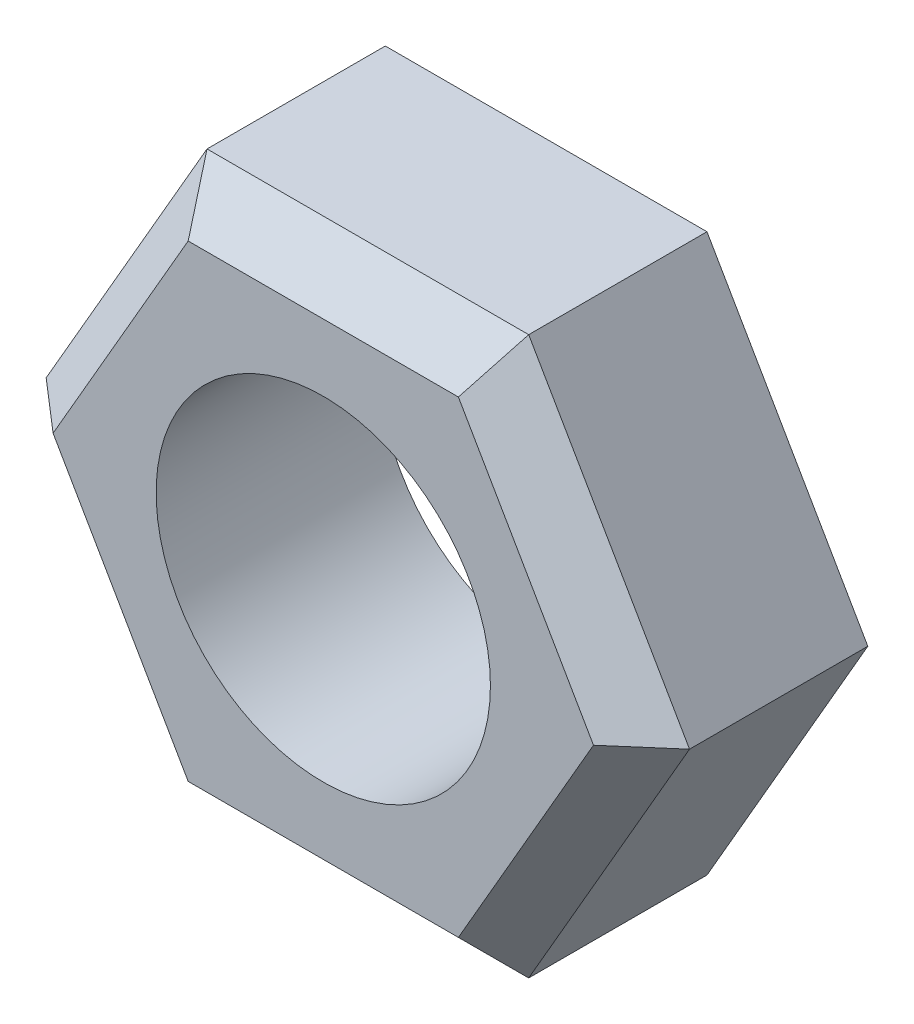
ISO-10303-21;
HEADER;
FILE_DESCRIPTION(('STEP AP214'),'2;1');
FILE_NAME('part.step','',(''),(''),'','','');
FILE_SCHEMA(('AUTOMOTIVE_DESIGN { 1 0 10303 214 1 1 1 1 }'));
ENDSEC;
DATA;
#1=APPLICATION_CONTEXT('core data for automotive mechanical design processes');
#2=APPLICATION_PROTOCOL_DEFINITION('international standard','automotive_design',2000,#1);
#3=PRODUCT_CONTEXT('',#1,'mechanical');
#4=PRODUCT('Part','Part','',(#3));
#5=PRODUCT_RELATED_PRODUCT_CATEGORY('part','',(#4));
#6=PRODUCT_DEFINITION_FORMATION('','',#4);
#7=PRODUCT_DEFINITION_CONTEXT('part definition',#1,'design');
#8=PRODUCT_DEFINITION('design','',#6,#7);
#9=PRODUCT_DEFINITION_SHAPE('','',#8);
#10=(LENGTH_UNIT() NAMED_UNIT(*) SI_UNIT(.MILLI.,.METRE.));
#11=(NAMED_UNIT(*) PLANE_ANGLE_UNIT() SI_UNIT($,.RADIAN.));
#12=(NAMED_UNIT(*) SI_UNIT($,.STERADIAN.) SOLID_ANGLE_UNIT());
#13=UNCERTAINTY_MEASURE_WITH_UNIT(LENGTH_MEASURE(1.E-05),#10,'distance_accuracy_value','');
#14=(GEOMETRIC_REPRESENTATION_CONTEXT(3) GLOBAL_UNCERTAINTY_ASSIGNED_CONTEXT((#13)) GLOBAL_UNIT_ASSIGNED_CONTEXT((#10,
#11,#12)) REPRESENTATION_CONTEXT('',''));
#15=CARTESIAN_POINT('',(0.,0.,0.));
#16=DIRECTION('',(0.,0.,1.));
#17=DIRECTION('',(1.,0.,0.));
#18=AXIS2_PLACEMENT_3D('',#15,#16,#17);
#19=CARTESIAN_POINT('',(0.,0.,10.));
#20=DIRECTION('',(0.,0.,1.));
#21=DIRECTION('',(1.,0.,0.));
#22=AXIS2_PLACEMENT_3D('',#19,#20,#21);
#23=PLANE('',#22);
#24=DIRECTION('',(-0.5,-0.866025403784439,0.));
#25=VECTOR('',#24,1.);
#26=CARTESIAN_POINT('',(-12.7017059221718,-0.999999999999999,10.));
#27=LINE('',#26,#25);
#28=CARTESIAN_POINT('',(-6.06217782649108,10.5,10.));
#29=VERTEX_POINT('',#28);
#30=CARTESIAN_POINT('',(-12.1243556529822,0.,10.));
#31=VERTEX_POINT('',#30);
#32=EDGE_CURVE('E178',#29,#31,#27,.T.);
#33=ORIENTED_EDGE('',*,*,#32,.T.);
#34=DIRECTION('',(0.5,-0.866025403784439,0.));
#35=VECTOR('',#34,1.);
#36=CARTESIAN_POINT('',(-5.48482755730145,-11.5,10.));
#37=LINE('',#36,#35);
#38=CARTESIAN_POINT('',(-6.06217782649107,-10.5,10.));
#39=VERTEX_POINT('',#38);
#40=EDGE_CURVE('E190',#31,#39,#37,.T.);
#41=ORIENTED_EDGE('',*,*,#40,.T.);
#42=DIRECTION('',(1.,0.,0.));
#43=VECTOR('',#42,1.);
#44=CARTESIAN_POINT('',(7.21687836487032,-10.5,10.));
#45=LINE('',#44,#43);
#46=CARTESIAN_POINT('',(6.06217782649107,-10.5,10.));
#47=VERTEX_POINT('',#46);
#48=EDGE_CURVE('E187',#39,#47,#45,.T.);
#49=ORIENTED_EDGE('',*,*,#48,.T.);
#50=DIRECTION('',(0.5,0.866025403784439,0.));
#51=VECTOR('',#50,1.);
#52=CARTESIAN_POINT('',(12.7017059221718,0.999999999999999,10.));
#53=LINE('',#52,#51);
#54=CARTESIAN_POINT('',(12.1243556529821,0.,10.));
#55=VERTEX_POINT('',#54);
#56=EDGE_CURVE('E184',#47,#55,#53,.T.);
#57=ORIENTED_EDGE('',*,*,#56,.T.);
#58=DIRECTION('',(-0.5,0.866025403784439,0.));
#59=VECTOR('',#58,1.);
#60=CARTESIAN_POINT('',(5.48482755730144,11.5,10.));
#61=LINE('',#60,#59);
#62=CARTESIAN_POINT('',(6.06217782649106,10.5,10.));
#63=VERTEX_POINT('',#62);
#64=EDGE_CURVE('E181',#55,#63,#61,.T.);
#65=ORIENTED_EDGE('',*,*,#64,.T.);
#66=DIRECTION('',(-1.,0.,0.));
#67=VECTOR('',#66,1.);
#68=CARTESIAN_POINT('',(-7.21687836487033,10.5,10.));
#69=LINE('',#68,#67);
#70=EDGE_CURVE('E123',#63,#29,#69,.T.);
#71=ORIENTED_EDGE('',*,*,#70,.T.);
#72=EDGE_LOOP('',(#33,#41,#49,#57,#65,#71));
#73=FACE_BOUND('',#72,.T.);
#74=CARTESIAN_POINT('',(0.,0.,10.));
#75=DIRECTION('',(0.,0.,1.));
#76=DIRECTION('',(1.,0.,0.));
#77=AXIS2_PLACEMENT_3D('',#74,#75,#76);
#78=CIRCLE('',#77,7.5);
#79=CARTESIAN_POINT('',(7.5,0.,10.));
#80=VERTEX_POINT('',#79);
#81=EDGE_CURVE('E142',#80,#80,#78,.T.);
#82=ORIENTED_EDGE('',*,*,#81,.F.);
#83=EDGE_LOOP('',(#82));
#84=FACE_BOUND('',#83,.T.);
#85=ADVANCED_FACE('F39',(#73,#84),#23,.T.);
#86=CARTESIAN_POINT('',(0.,0.,0.));
#87=DIRECTION('',(0.,0.,1.));
#88=DIRECTION('',(1.,0.,0.));
#89=AXIS2_PLACEMENT_3D('',#86,#87,#88);
#90=PLANE('',#89);
#91=DIRECTION('',(1.,0.,0.));
#92=VECTOR('',#91,1.);
#93=CARTESIAN_POINT('',(-7.21687836487033,-12.5,0.));
#94=LINE('',#93,#92);
#95=CARTESIAN_POINT('',(-7.21687836487033,-12.5,0.));
#96=VERTEX_POINT('',#95);
#97=CARTESIAN_POINT('',(7.21687836487032,-12.5,0.));
#98=VERTEX_POINT('',#97);
#99=EDGE_CURVE('E131',#96,#98,#94,.T.);
#100=ORIENTED_EDGE('',*,*,#99,.F.);
#101=DIRECTION('',(0.5,-0.866025403784438,0.));
#102=VECTOR('',#101,1.);
#103=CARTESIAN_POINT('',(-14.4337567297407,0.,0.));
#104=LINE('',#103,#102);
#105=CARTESIAN_POINT('',(-14.4337567297407,0.,0.));
#106=VERTEX_POINT('',#105);
#107=EDGE_CURVE('E160',#106,#96,#104,.T.);
#108=ORIENTED_EDGE('',*,*,#107,.F.);
#109=DIRECTION('',(-0.5,-0.866025403784439,0.));
#110=VECTOR('',#109,1.);
#111=CARTESIAN_POINT('',(-7.21687836487033,12.5,0.));
#112=LINE('',#111,#110);
#113=CARTESIAN_POINT('',(-7.21687836487033,12.5,0.));
#114=VERTEX_POINT('',#113);
#115=EDGE_CURVE('E156',#114,#106,#112,.T.);
#116=ORIENTED_EDGE('',*,*,#115,.F.);
#117=DIRECTION('',(-1.,0.,0.));
#118=VECTOR('',#117,1.);
#119=CARTESIAN_POINT('',(7.21687836487031,12.5,0.));
#120=LINE('',#119,#118);
#121=CARTESIAN_POINT('',(7.21687836487031,12.5,0.));
#122=VERTEX_POINT('',#121);
#123=EDGE_CURVE('E152',#122,#114,#120,.T.);
#124=ORIENTED_EDGE('',*,*,#123,.F.);
#125=DIRECTION('',(-0.5,0.866025403784438,0.));
#126=VECTOR('',#125,1.);
#127=CARTESIAN_POINT('',(14.4337567297406,0.,0.));
#128=LINE('',#127,#126);
#129=CARTESIAN_POINT('',(14.4337567297406,0.,0.));
#130=VERTEX_POINT('',#129);
#131=EDGE_CURVE('E134',#130,#122,#128,.T.);
#132=ORIENTED_EDGE('',*,*,#131,.F.);
#133=DIRECTION('',(0.5,0.866025403784439,0.));
#134=VECTOR('',#133,1.);
#135=CARTESIAN_POINT('',(7.21687836487032,-12.5,0.));
#136=LINE('',#135,#134);
#137=EDGE_CURVE('E115',#98,#130,#136,.T.);
#138=ORIENTED_EDGE('',*,*,#137,.F.);
#139=EDGE_LOOP('',(#100,#108,#116,#124,#132,#138));
#140=FACE_BOUND('',#139,.T.);
#141=CARTESIAN_POINT('',(0.,0.,0.));
#142=DIRECTION('',(0.,0.,1.));
#143=DIRECTION('',(1.,0.,0.));
#144=AXIS2_PLACEMENT_3D('',#141,#142,#143);
#145=CIRCLE('',#144,7.5);
#146=CARTESIAN_POINT('',(7.5,0.,0.));
#147=VERTEX_POINT('',#146);
#148=EDGE_CURVE('E146',#147,#147,#145,.T.);
#149=ORIENTED_EDGE('',*,*,#148,.T.);
#150=EDGE_LOOP('',(#149));
#151=FACE_BOUND('',#150,.T.);
#152=ADVANCED_FACE('F128',(#140,#151),#90,.F.);
#153=CARTESIAN_POINT('',(-7.21687836487033,-12.5,10.));
#154=DIRECTION('',(0.,1.,0.));
#155=DIRECTION('',(0.,0.,1.));
#156=AXIS2_PLACEMENT_3D('',#153,#154,#155);
#157=PLANE('',#156);
#158=DIRECTION('',(0.,0.,-1.));
#159=VECTOR('',#158,1.);
#160=CARTESIAN_POINT('',(7.21687836487032,-12.5,10.));
#161=LINE('',#160,#159);
#162=CARTESIAN_POINT('',(7.21687836487032,-12.5,7.99999999999999));
#163=VERTEX_POINT('',#162);
#164=EDGE_CURVE('E111',#163,#98,#161,.T.);
#165=ORIENTED_EDGE('',*,*,#164,.F.);
#166=DIRECTION('',(-1.,0.,0.));
#167=VECTOR('',#166,1.);
#168=CARTESIAN_POINT('',(-7.21687836487033,-12.5,7.99999999999999));
#169=LINE('',#168,#167);
#170=CARTESIAN_POINT('',(-7.21687836487033,-12.5,7.99999999999999));
#171=VERTEX_POINT('',#170);
#172=EDGE_CURVE('E198',#163,#171,#169,.T.);
#173=ORIENTED_EDGE('',*,*,#172,.T.);
#174=DIRECTION('',(0.,0.,-1.));
#175=VECTOR('',#174,1.);
#176=CARTESIAN_POINT('',(-7.21687836487033,-12.5,10.));
#177=LINE('',#176,#175);
#178=EDGE_CURVE('E139',#171,#96,#177,.T.);
#179=ORIENTED_EDGE('',*,*,#178,.T.);
#180=ORIENTED_EDGE('',*,*,#99,.T.);
#181=EDGE_LOOP('',(#165,#173,#179,#180));
#182=FACE_BOUND('',#181,.T.);
#183=ADVANCED_FACE('F137',(#182),#157,.F.);
#184=CARTESIAN_POINT('',(7.21687836487032,-12.5,10.));
#185=DIRECTION('',(-0.866025403784438,0.5,0.));
#186=DIRECTION('',(-0.5,-0.866025403784439,0.));
#187=AXIS2_PLACEMENT_3D('',#184,#185,#186);
#188=PLANE('',#187);
#189=DIRECTION('',(0.,0.,-1.));
#190=VECTOR('',#189,1.);
#191=CARTESIAN_POINT('',(14.4337567297406,0.,10.));
#192=LINE('',#191,#190);
#193=CARTESIAN_POINT('',(14.4337567297406,0.,7.99999999999999));
#194=VERTEX_POINT('',#193);
#195=EDGE_CURVE('E124',#194,#130,#192,.T.);
#196=ORIENTED_EDGE('',*,*,#195,.F.);
#197=DIRECTION('',(-0.5,-0.866025403784439,0.));
#198=VECTOR('',#197,1.);
#199=CARTESIAN_POINT('',(7.21687836487032,-12.5,7.99999999999999));
#200=LINE('',#199,#198);
#201=EDGE_CURVE('E118',#194,#163,#200,.T.);
#202=ORIENTED_EDGE('',*,*,#201,.T.);
#203=ORIENTED_EDGE('',*,*,#164,.T.);
#204=ORIENTED_EDGE('',*,*,#137,.T.);
#205=EDGE_LOOP('',(#196,#202,#203,#204));
#206=FACE_BOUND('',#205,.T.);
#207=ADVANCED_FACE('F114',(#206),#188,.F.);
#208=CARTESIAN_POINT('',(14.4337567297406,0.,10.));
#209=DIRECTION('',(-0.866025403784438,-0.5,0.));
#210=DIRECTION('',(0.5,-0.866025403784439,0.));
#211=AXIS2_PLACEMENT_3D('',#208,#209,#210);
#212=PLANE('',#211);
#213=DIRECTION('',(0.,0.,-1.));
#214=VECTOR('',#213,1.);
#215=CARTESIAN_POINT('',(7.21687836487031,12.5,10.));
#216=LINE('',#215,#214);
#217=CARTESIAN_POINT('',(7.21687836487031,12.5,7.99999999999999));
#218=VERTEX_POINT('',#217);
#219=EDGE_CURVE('E171',#218,#122,#216,.T.);
#220=ORIENTED_EDGE('',*,*,#219,.F.);
#221=DIRECTION('',(0.5,-0.866025403784439,0.));
#222=VECTOR('',#221,1.);
#223=CARTESIAN_POINT('',(14.4337567297406,0.,7.99999999999999));
#224=LINE('',#223,#222);
#225=EDGE_CURVE('E203',#218,#194,#224,.T.);
#226=ORIENTED_EDGE('',*,*,#225,.T.);
#227=ORIENTED_EDGE('',*,*,#195,.T.);
#228=ORIENTED_EDGE('',*,*,#131,.T.);
#229=EDGE_LOOP('',(#220,#226,#227,#228));
#230=FACE_BOUND('',#229,.T.);
#231=ADVANCED_FACE('F264',(#230),#212,.F.);
#232=CARTESIAN_POINT('',(7.21687836487031,12.5,10.));
#233=DIRECTION('',(0.,-1.,0.));
#234=DIRECTION('',(1.,0.,0.));
#235=AXIS2_PLACEMENT_3D('',#232,#233,#234);
#236=PLANE('',#235);
#237=DIRECTION('',(0.,0.,-1.));
#238=VECTOR('',#237,1.);
#239=CARTESIAN_POINT('',(-7.21687836487033,12.5,10.));
#240=LINE('',#239,#238);
#241=CARTESIAN_POINT('',(-7.21687836487033,12.5,7.99999999999999));
#242=VERTEX_POINT('',#241);
#243=EDGE_CURVE('E168',#242,#114,#240,.T.);
#244=ORIENTED_EDGE('',*,*,#243,.F.);
#245=DIRECTION('',(1.,0.,0.));
#246=VECTOR('',#245,1.);
#247=CARTESIAN_POINT('',(7.21687836487031,12.5,7.99999999999999));
#248=LINE('',#247,#246);
#249=EDGE_CURVE('E11',#242,#218,#248,.T.);
#250=ORIENTED_EDGE('',*,*,#249,.T.);
#251=ORIENTED_EDGE('',*,*,#219,.T.);
#252=ORIENTED_EDGE('',*,*,#123,.T.);
#253=EDGE_LOOP('',(#244,#250,#251,#252));
#254=FACE_BOUND('',#253,.T.);
#255=ADVANCED_FACE('F261',(#254),#236,.F.);
#256=CARTESIAN_POINT('',(-7.21687836487033,12.5,10.));
#257=DIRECTION('',(0.866025403784439,-0.5,0.));
#258=DIRECTION('',(0.5,0.866025403784439,0.));
#259=AXIS2_PLACEMENT_3D('',#256,#257,#258);
#260=PLANE('',#259);
#261=DIRECTION('',(0.,0.,-1.));
#262=VECTOR('',#261,1.);
#263=CARTESIAN_POINT('',(-14.4337567297407,0.,10.));
#264=LINE('',#263,#262);
#265=CARTESIAN_POINT('',(-14.4337567297407,0.,7.99999999999999));
#266=VERTEX_POINT('',#265);
#267=EDGE_CURVE('E165',#266,#106,#264,.T.);
#268=ORIENTED_EDGE('',*,*,#267,.F.);
#269=DIRECTION('',(0.5,0.866025403784439,0.));
#270=VECTOR('',#269,1.);
#271=CARTESIAN_POINT('',(-7.21687836487033,12.5,7.99999999999999));
#272=LINE('',#271,#270);
#273=EDGE_CURVE('E49',#266,#242,#272,.T.);
#274=ORIENTED_EDGE('',*,*,#273,.T.);
#275=ORIENTED_EDGE('',*,*,#243,.T.);
#276=ORIENTED_EDGE('',*,*,#115,.T.);
#277=EDGE_LOOP('',(#268,#274,#275,#276));
#278=FACE_BOUND('',#277,.T.);
#279=ADVANCED_FACE('F247',(#278),#260,.F.);
#280=CARTESIAN_POINT('',(-14.4337567297407,0.,10.));
#281=DIRECTION('',(0.866025403784438,0.5,0.));
#282=DIRECTION('',(-0.5,0.866025403784438,0.));
#283=AXIS2_PLACEMENT_3D('',#280,#281,#282);
#284=PLANE('',#283);
#285=ORIENTED_EDGE('',*,*,#178,.F.);
#286=DIRECTION('',(-0.5,0.866025403784438,0.));
#287=VECTOR('',#286,1.);
#288=CARTESIAN_POINT('',(-14.4337567297407,0.,7.99999999999999));
#289=LINE('',#288,#287);
#290=EDGE_CURVE('E194',#171,#266,#289,.T.);
#291=ORIENTED_EDGE('',*,*,#290,.T.);
#292=ORIENTED_EDGE('',*,*,#267,.T.);
#293=ORIENTED_EDGE('',*,*,#107,.T.);
#294=EDGE_LOOP('',(#285,#291,#292,#293));
#295=FACE_BOUND('',#294,.T.);
#296=ADVANCED_FACE('F238',(#295),#284,.F.);
#297=CARTESIAN_POINT('',(0.,0.,10.));
#298=DIRECTION('',(0.,0.,-1.));
#299=DIRECTION('',(-1.,0.,0.));
#300=AXIS2_PLACEMENT_3D('',#297,#298,#299);
#301=CYLINDRICAL_SURFACE('',#300,7.5);
#302=ORIENTED_EDGE('',*,*,#81,.T.);
#303=EDGE_LOOP('',(#302));
#304=FACE_BOUND('',#303,.T.);
#305=ORIENTED_EDGE('',*,*,#148,.F.);
#306=EDGE_LOOP('',(#305));
#307=FACE_BOUND('',#306,.T.);
#308=ADVANCED_FACE('F236',(#304,#307),#301,.F.);
#309=CARTESIAN_POINT('',(9.09326673973661,5.25,10.));
#310=DIRECTION('',(0.612372435695796,0.353553390593275,0.707106781186546));
#311=DIRECTION('',(0.5,-0.866025403784439,0.));
#312=AXIS2_PLACEMENT_3D('',#309,#310,#311);
#313=PLANE('',#312);
#314=DIRECTION('',(0.755928946018453,0.,-0.654653670707979));
#315=VECTOR('',#314,1.);
#316=CARTESIAN_POINT('',(10.3923048454133,0.,11.5));
#317=LINE('',#316,#315);
#318=EDGE_CURVE('E221',#194,#55,#317,.F.);
#319=ORIENTED_EDGE('',*,*,#318,.F.);
#320=ORIENTED_EDGE('',*,*,#225,.F.);
#321=DIRECTION('',(0.377964473009226,0.654653670707975,-0.654653670707979));
#322=VECTOR('',#321,1.);
#323=CARTESIAN_POINT('',(5.19615242270663,9.00000000000002,11.5));
#324=LINE('',#323,#322);
#325=EDGE_CURVE('E43',#63,#218,#324,.T.);
#326=ORIENTED_EDGE('',*,*,#325,.F.);
#327=ORIENTED_EDGE('',*,*,#64,.F.);
#328=EDGE_LOOP('',(#319,#320,#326,#327));
#329=FACE_BOUND('',#328,.T.);
#330=ADVANCED_FACE('F41',(#329),#313,.T.);
#331=CARTESIAN_POINT('',(0.,10.5,10.));
#332=DIRECTION('',(0.,0.707106781186549,0.707106781186545));
#333=DIRECTION('',(1.,0.,0.));
#334=AXIS2_PLACEMENT_3D('',#331,#332,#333);
#335=PLANE('',#334);
#336=ORIENTED_EDGE('',*,*,#325,.T.);
#337=ORIENTED_EDGE('',*,*,#249,.F.);
#338=DIRECTION('',(0.377964473009226,-0.654653670707976,0.654653670707979));
#339=VECTOR('',#338,1.);
#340=CARTESIAN_POINT('',(-5.19615242270664,9.00000000000002,11.5));
#341=LINE('',#340,#339);
#342=EDGE_CURVE('E218',#29,#242,#341,.F.);
#343=ORIENTED_EDGE('',*,*,#342,.F.);
#344=ORIENTED_EDGE('',*,*,#70,.F.);
#345=EDGE_LOOP('',(#336,#337,#343,#344));
#346=FACE_BOUND('',#345,.T.);
#347=ADVANCED_FACE('F245',(#346),#335,.T.);
#348=CARTESIAN_POINT('',(9.09326673973661,-5.25,10.));
#349=DIRECTION('',(0.612372435695796,-0.353553390593275,0.707106781186546));
#350=DIRECTION('',(-0.5,-0.866025403784439,0.));
#351=AXIS2_PLACEMENT_3D('',#348,#349,#350);
#352=PLANE('',#351);
#353=ORIENTED_EDGE('',*,*,#318,.T.);
#354=ORIENTED_EDGE('',*,*,#56,.F.);
#355=DIRECTION('',(0.377964473009227,-0.654653670707976,-0.654653670707979));
#356=VECTOR('',#355,1.);
#357=CARTESIAN_POINT('',(5.19615242270663,-9.00000000000001,11.5));
#358=LINE('',#357,#356);
#359=EDGE_CURVE('E214',#163,#47,#358,.F.);
#360=ORIENTED_EDGE('',*,*,#359,.F.);
#361=ORIENTED_EDGE('',*,*,#201,.F.);
#362=EDGE_LOOP('',(#353,#354,#360,#361));
#363=FACE_BOUND('',#362,.T.);
#364=ADVANCED_FACE('F283',(#363),#352,.T.);
#365=CARTESIAN_POINT('',(-9.09326673973662,5.25000000000001,10.));
#366=DIRECTION('',(-0.612372435695796,0.353553390593275,0.707106781186545));
#367=DIRECTION('',(0.5,0.866025403784439,0.));
#368=AXIS2_PLACEMENT_3D('',#365,#366,#367);
#369=PLANE('',#368);
#370=ORIENTED_EDGE('',*,*,#342,.T.);
#371=ORIENTED_EDGE('',*,*,#273,.F.);
#372=DIRECTION('',(0.755928946018453,0.,0.654653670707979));
#373=VECTOR('',#372,1.);
#374=CARTESIAN_POINT('',(-10.3923048454133,0.,11.5));
#375=LINE('',#374,#373);
#376=EDGE_CURVE('E211',#31,#266,#375,.F.);
#377=ORIENTED_EDGE('',*,*,#376,.F.);
#378=ORIENTED_EDGE('',*,*,#32,.F.);
#379=EDGE_LOOP('',(#370,#371,#377,#378));
#380=FACE_BOUND('',#379,.T.);
#381=ADVANCED_FACE('F279',(#380),#369,.T.);
#382=CARTESIAN_POINT('',(0.,-10.5,10.));
#383=DIRECTION('',(0.,-0.707106781186549,0.707106781186546));
#384=DIRECTION('',(-1.,0.,0.));
#385=AXIS2_PLACEMENT_3D('',#382,#383,#384);
#386=PLANE('',#385);
#387=ORIENTED_EDGE('',*,*,#359,.T.);
#388=ORIENTED_EDGE('',*,*,#48,.F.);
#389=DIRECTION('',(-0.377964473009226,-0.654653670707976,-0.654653670707979));
#390=VECTOR('',#389,1.);
#391=CARTESIAN_POINT('',(-5.19615242270664,-9.00000000000001,11.5));
#392=LINE('',#391,#390);
#393=EDGE_CURVE('E208',#171,#39,#392,.F.);
#394=ORIENTED_EDGE('',*,*,#393,.F.);
#395=ORIENTED_EDGE('',*,*,#172,.F.);
#396=EDGE_LOOP('',(#387,#388,#394,#395));
#397=FACE_BOUND('',#396,.T.);
#398=ADVANCED_FACE('F275',(#397),#386,.T.);
#399=CARTESIAN_POINT('',(-9.09326673973661,-5.25000000000001,10.));
#400=DIRECTION('',(-0.612372435695796,-0.353553390593275,0.707106781186546));
#401=DIRECTION('',(-0.5,0.866025403784438,0.));
#402=AXIS2_PLACEMENT_3D('',#399,#400,#401);
#403=PLANE('',#402);
#404=ORIENTED_EDGE('',*,*,#376,.T.);
#405=ORIENTED_EDGE('',*,*,#290,.F.);
#406=ORIENTED_EDGE('',*,*,#393,.T.);
#407=ORIENTED_EDGE('',*,*,#40,.F.);
#408=EDGE_LOOP('',(#404,#405,#406,#407));
#409=FACE_BOUND('',#408,.T.);
#410=ADVANCED_FACE('F272',(#409),#403,.T.);
#411=CLOSED_SHELL('',(#85,#152,#183,#207,#231,#255,#279,#296,#308,#330,#347,#364,#381,#398,#410));
#412=MANIFOLD_SOLID_BREP('B2',#411);
#413=ADVANCED_BREP_SHAPE_REPRESENTATION('',(#18,#412),#14);
#414=SHAPE_DEFINITION_REPRESENTATION(#9,#413);
ENDSEC;
END-ISO-10303-21;
